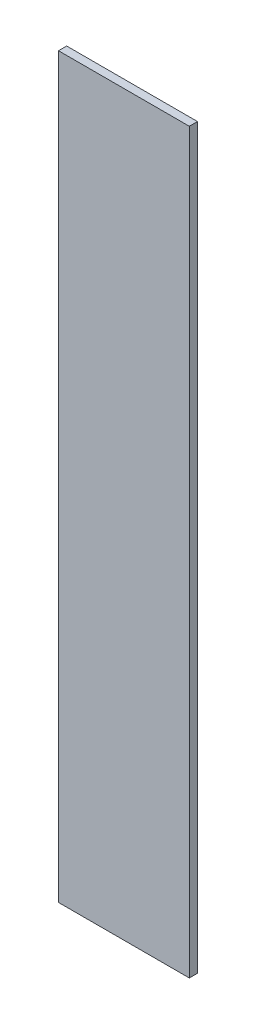
ISO-10303-21;
HEADER;
FILE_DESCRIPTION(('STEP AP214'),'2;1');
FILE_NAME('part.step','',(''),(''),'','','');
FILE_SCHEMA(('AUTOMOTIVE_DESIGN { 1 0 10303 214 1 1 1 1 }'));
ENDSEC;
DATA;
#1=APPLICATION_CONTEXT('core data for automotive mechanical design processes');
#2=APPLICATION_PROTOCOL_DEFINITION('international standard','automotive_design',2000,#1);
#3=PRODUCT_CONTEXT('',#1,'mechanical');
#4=PRODUCT('Part','Part','',(#3));
#5=PRODUCT_RELATED_PRODUCT_CATEGORY('part','',(#4));
#6=PRODUCT_DEFINITION_FORMATION('','',#4);
#7=PRODUCT_DEFINITION_CONTEXT('part definition',#1,'design');
#8=PRODUCT_DEFINITION('design','',#6,#7);
#9=PRODUCT_DEFINITION_SHAPE('','',#8);
#10=(LENGTH_UNIT() NAMED_UNIT(*) SI_UNIT(.MILLI.,.METRE.));
#11=(NAMED_UNIT(*) PLANE_ANGLE_UNIT() SI_UNIT($,.RADIAN.));
#12=(NAMED_UNIT(*) SI_UNIT($,.STERADIAN.) SOLID_ANGLE_UNIT());
#13=UNCERTAINTY_MEASURE_WITH_UNIT(LENGTH_MEASURE(1.E-05),#10,'distance_accuracy_value','');
#14=(GEOMETRIC_REPRESENTATION_CONTEXT(3) GLOBAL_UNCERTAINTY_ASSIGNED_CONTEXT((#13)) GLOBAL_UNIT_ASSIGNED_CONTEXT((#10,
#11,#12)) REPRESENTATION_CONTEXT('',''));
#15=CARTESIAN_POINT('',(0.,0.,0.));
#16=DIRECTION('',(0.,0.,1.));
#17=DIRECTION('',(1.,0.,0.));
#18=AXIS2_PLACEMENT_3D('',#15,#16,#17);
#19=CARTESIAN_POINT('',(-1.6652839175371,0.,2.18));
#20=DIRECTION('',(0.,0.,1.));
#21=DIRECTION('',(1.,0.,0.));
#22=AXIS2_PLACEMENT_3D('',#19,#20,#21);
#23=PLANE('',#22);
#24=DIRECTION('',(1.,0.,0.));
#25=VECTOR('',#24,1.);
#26=CARTESIAN_POINT('',(-1.6652839175371,1.1275,2.18));
#27=LINE('',#26,#25);
#28=CARTESIAN_POINT('',(-1.8652839175371,1.1275,2.18));
#29=VERTEX_POINT('',#28);
#30=CARTESIAN_POINT('',(-1.4652839175371,1.1275,2.18));
#31=VERTEX_POINT('',#30);
#32=EDGE_CURVE('E77',#29,#31,#27,.T.);
#33=ORIENTED_EDGE('',*,*,#32,.T.);
#34=DIRECTION('',(0.,-1.,0.));
#35=VECTOR('',#34,1.);
#36=CARTESIAN_POINT('',(-1.4652839175371,0.,2.18));
#37=LINE('',#36,#35);
#38=CARTESIAN_POINT('',(-1.4652839175371,-1.1275,2.18));
#39=VERTEX_POINT('',#38);
#40=EDGE_CURVE('E26',#31,#39,#37,.T.);
#41=ORIENTED_EDGE('',*,*,#40,.T.);
#42=DIRECTION('',(1.,0.,0.));
#43=VECTOR('',#42,1.);
#44=CARTESIAN_POINT('',(-1.6652839175371,-1.1275,2.18));
#45=LINE('',#44,#43);
#46=CARTESIAN_POINT('',(-1.8652839175371,-1.1275,2.18));
#47=VERTEX_POINT('',#46);
#48=EDGE_CURVE('E79',#47,#39,#45,.T.);
#49=ORIENTED_EDGE('',*,*,#48,.F.);
#50=DIRECTION('',(0.,-1.,0.));
#51=VECTOR('',#50,1.);
#52=CARTESIAN_POINT('',(-1.8652839175371,0.,2.18));
#53=LINE('',#52,#51);
#54=EDGE_CURVE('E75',#29,#47,#53,.T.);
#55=ORIENTED_EDGE('',*,*,#54,.F.);
#56=EDGE_LOOP('',(#33,#41,#49,#55));
#57=FACE_BOUND('',#56,.T.);
#58=ADVANCED_FACE('F17',(#57),#23,.F.);
#59=CARTESIAN_POINT('',(-1.6652839175371,0.,2.205));
#60=DIRECTION('',(0.,0.,1.));
#61=DIRECTION('',(1.,0.,0.));
#62=AXIS2_PLACEMENT_3D('',#59,#60,#61);
#63=PLANE('',#62);
#64=DIRECTION('',(1.,0.,0.));
#65=VECTOR('',#64,1.);
#66=CARTESIAN_POINT('',(-1.6652839175371,1.1275,2.205));
#67=LINE('',#66,#65);
#68=CARTESIAN_POINT('',(-1.8652839175371,1.1275,2.205));
#69=VERTEX_POINT('',#68);
#70=CARTESIAN_POINT('',(-1.4652839175371,1.1275,2.205));
#71=VERTEX_POINT('',#70);
#72=EDGE_CURVE('E91',#69,#71,#67,.T.);
#73=ORIENTED_EDGE('',*,*,#72,.F.);
#74=DIRECTION('',(0.,-1.,0.));
#75=VECTOR('',#74,1.);
#76=CARTESIAN_POINT('',(-1.8652839175371,0.,2.205));
#77=LINE('',#76,#75);
#78=CARTESIAN_POINT('',(-1.8652839175371,-1.1275,2.205));
#79=VERTEX_POINT('',#78);
#80=EDGE_CURVE('E63',#69,#79,#77,.T.);
#81=ORIENTED_EDGE('',*,*,#80,.T.);
#82=DIRECTION('',(1.,0.,0.));
#83=VECTOR('',#82,1.);
#84=CARTESIAN_POINT('',(-1.6652839175371,-1.1275,2.205));
#85=LINE('',#84,#83);
#86=CARTESIAN_POINT('',(-1.4652839175371,-1.1275,2.205));
#87=VERTEX_POINT('',#86);
#88=EDGE_CURVE('E104',#79,#87,#85,.T.);
#89=ORIENTED_EDGE('',*,*,#88,.T.);
#90=DIRECTION('',(0.,-1.,0.));
#91=VECTOR('',#90,1.);
#92=CARTESIAN_POINT('',(-1.4652839175371,0.,2.205));
#93=LINE('',#92,#91);
#94=EDGE_CURVE('E11',#71,#87,#93,.T.);
#95=ORIENTED_EDGE('',*,*,#94,.F.);
#96=EDGE_LOOP('',(#73,#81,#89,#95));
#97=FACE_BOUND('',#96,.T.);
#98=ADVANCED_FACE('F119',(#97),#63,.T.);
#99=CARTESIAN_POINT('',(-1.4652839175371,0.,2.205));
#100=DIRECTION('',(1.,0.,0.));
#101=DIRECTION('',(0.,1.,0.));
#102=AXIS2_PLACEMENT_3D('',#99,#100,#101);
#103=PLANE('',#102);
#104=ORIENTED_EDGE('',*,*,#40,.F.);
#105=DIRECTION('',(0.,0.,-1.));
#106=VECTOR('',#105,1.);
#107=CARTESIAN_POINT('',(-1.4652839175371,1.1275,2.205));
#108=LINE('',#107,#106);
#109=EDGE_CURVE('E83',#71,#31,#108,.T.);
#110=ORIENTED_EDGE('',*,*,#109,.F.);
#111=ORIENTED_EDGE('',*,*,#94,.T.);
#112=DIRECTION('',(0.,0.,-1.));
#113=VECTOR('',#112,1.);
#114=CARTESIAN_POINT('',(-1.4652839175371,-1.1275,2.205));
#115=LINE('',#114,#113);
#116=EDGE_CURVE('E101',#87,#39,#115,.T.);
#117=ORIENTED_EDGE('',*,*,#116,.T.);
#118=EDGE_LOOP('',(#104,#110,#111,#117));
#119=FACE_BOUND('',#118,.T.);
#120=ADVANCED_FACE('F121',(#119),#103,.T.);
#121=CARTESIAN_POINT('',(-1.6652839175371,-1.1275,2.205));
#122=DIRECTION('',(0.,1.,0.));
#123=DIRECTION('',(1.,0.,0.));
#124=AXIS2_PLACEMENT_3D('',#121,#122,#123);
#125=PLANE('',#124);
#126=ORIENTED_EDGE('',*,*,#48,.T.);
#127=ORIENTED_EDGE('',*,*,#116,.F.);
#128=ORIENTED_EDGE('',*,*,#88,.F.);
#129=DIRECTION('',(0.,0.,-1.));
#130=VECTOR('',#129,1.);
#131=CARTESIAN_POINT('',(-1.8652839175371,-1.1275,2.205));
#132=LINE('',#131,#130);
#133=EDGE_CURVE('E82',#79,#47,#132,.T.);
#134=ORIENTED_EDGE('',*,*,#133,.T.);
#135=EDGE_LOOP('',(#126,#127,#128,#134));
#136=FACE_BOUND('',#135,.T.);
#137=ADVANCED_FACE('F123',(#136),#125,.F.);
#138=CARTESIAN_POINT('',(-1.8652839175371,0.,2.205));
#139=DIRECTION('',(1.,0.,0.));
#140=DIRECTION('',(0.,1.,0.));
#141=AXIS2_PLACEMENT_3D('',#138,#139,#140);
#142=PLANE('',#141);
#143=ORIENTED_EDGE('',*,*,#54,.T.);
#144=ORIENTED_EDGE('',*,*,#133,.F.);
#145=ORIENTED_EDGE('',*,*,#80,.F.);
#146=DIRECTION('',(0.,0.,-1.));
#147=VECTOR('',#146,1.);
#148=CARTESIAN_POINT('',(-1.8652839175371,1.1275,2.205));
#149=LINE('',#148,#147);
#150=EDGE_CURVE('E86',#69,#29,#149,.T.);
#151=ORIENTED_EDGE('',*,*,#150,.T.);
#152=EDGE_LOOP('',(#143,#144,#145,#151));
#153=FACE_BOUND('',#152,.T.);
#154=ADVANCED_FACE('F87',(#153),#142,.F.);
#155=CARTESIAN_POINT('',(-1.6652839175371,1.1275,2.205));
#156=DIRECTION('',(0.,1.,0.));
#157=DIRECTION('',(1.,0.,0.));
#158=AXIS2_PLACEMENT_3D('',#155,#156,#157);
#159=PLANE('',#158);
#160=ORIENTED_EDGE('',*,*,#32,.F.);
#161=ORIENTED_EDGE('',*,*,#150,.F.);
#162=ORIENTED_EDGE('',*,*,#72,.T.);
#163=ORIENTED_EDGE('',*,*,#109,.T.);
#164=EDGE_LOOP('',(#160,#161,#162,#163));
#165=FACE_BOUND('',#164,.T.);
#166=ADVANCED_FACE('F93',(#165),#159,.T.);
#167=CLOSED_SHELL('',(#58,#98,#120,#137,#154,#166));
#168=MANIFOLD_SOLID_BREP('B1',#167);
#169=ADVANCED_BREP_SHAPE_REPRESENTATION('',(#18,#168),#14);
#170=SHAPE_DEFINITION_REPRESENTATION(#9,#169);
ENDSEC;
END-ISO-10303-21;
